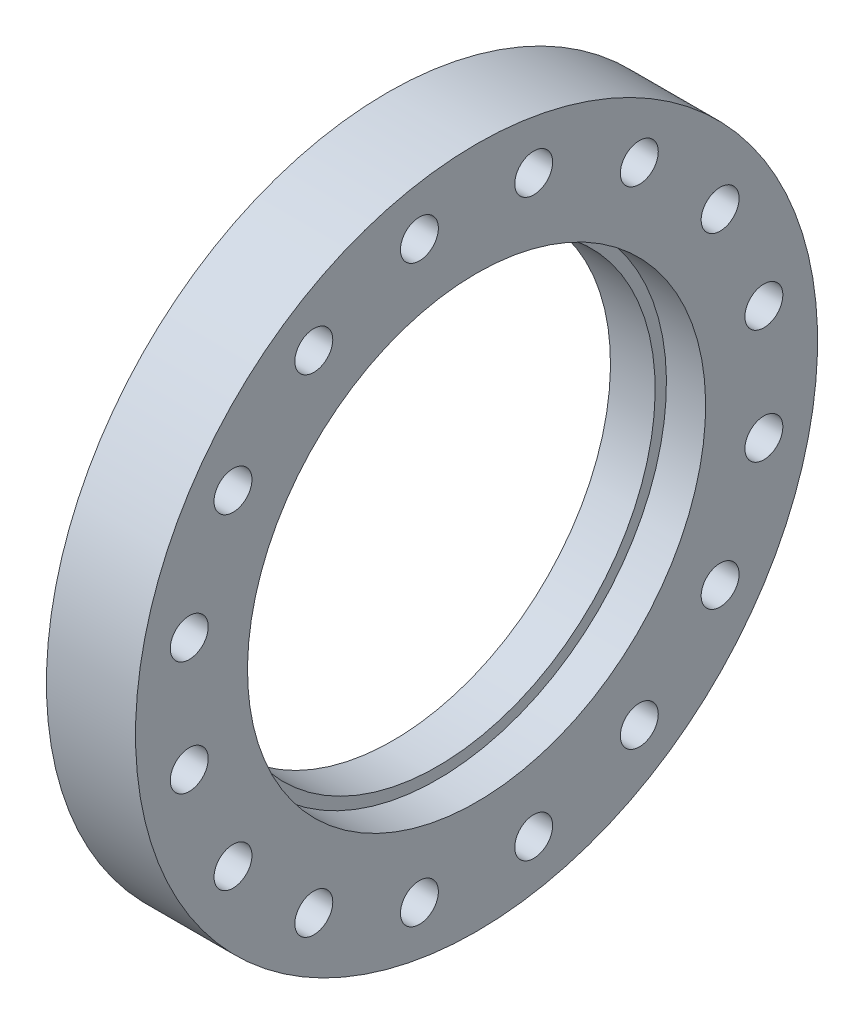
ISO-10303-21;
HEADER;
FILE_DESCRIPTION(('STEP AP214'),'2;1');
FILE_NAME('part.step','',(''),(''),'','','');
FILE_SCHEMA(('AUTOMOTIVE_DESIGN { 1 0 10303 214 1 1 1 1 }'));
ENDSEC;
DATA;
#1=APPLICATION_CONTEXT('core data for automotive mechanical design processes');
#2=APPLICATION_PROTOCOL_DEFINITION('international standard','automotive_design',2000,#1);
#3=PRODUCT_CONTEXT('',#1,'mechanical');
#4=PRODUCT('Part','Part','',(#3));
#5=PRODUCT_RELATED_PRODUCT_CATEGORY('part','',(#4));
#6=PRODUCT_DEFINITION_FORMATION('','',#4);
#7=PRODUCT_DEFINITION_CONTEXT('part definition',#1,'design');
#8=PRODUCT_DEFINITION('design','',#6,#7);
#9=PRODUCT_DEFINITION_SHAPE('','',#8);
#10=(LENGTH_UNIT() NAMED_UNIT(*) SI_UNIT(.MILLI.,.METRE.));
#11=(NAMED_UNIT(*) PLANE_ANGLE_UNIT() SI_UNIT($,.RADIAN.));
#12=(NAMED_UNIT(*) SI_UNIT($,.STERADIAN.) SOLID_ANGLE_UNIT());
#13=UNCERTAINTY_MEASURE_WITH_UNIT(LENGTH_MEASURE(1.E-05),#10,'distance_accuracy_value','');
#14=(GEOMETRIC_REPRESENTATION_CONTEXT(3) GLOBAL_UNCERTAINTY_ASSIGNED_CONTEXT((#13)) GLOBAL_UNIT_ASSIGNED_CONTEXT((#10,
#11,#12)) REPRESENTATION_CONTEXT('',''));
#15=CARTESIAN_POINT('',(0.,0.,0.));
#16=DIRECTION('',(0.,0.,1.));
#17=DIRECTION('',(1.,0.,0.));
#18=AXIS2_PLACEMENT_3D('',#15,#16,#17);
#19=CARTESIAN_POINT('',(1.17000000000035,53.038375,0.));
#20=DIRECTION('',(-1.,0.,0.));
#21=DIRECTION('',(0.,0.,1.));
#22=AXIS2_PLACEMENT_3D('',#19,#20,#21);
#23=PLANE('',#22);
#24=CARTESIAN_POINT('',(1.17000000000036,0.,0.));
#25=DIRECTION('',(1.,0.,0.));
#26=DIRECTION('',(0.,1.,0.));
#27=AXIS2_PLACEMENT_3D('',#24,#25,#26);
#28=CIRCLE('',#27,48.41875);
#29=CARTESIAN_POINT('',(1.17000000000035,48.41875,0.));
#30=VERTEX_POINT('',#29);
#31=EDGE_CURVE('E19',#30,#30,#28,.T.);
#32=ORIENTED_EDGE('',*,*,#31,.T.);
#33=EDGE_LOOP('',(#32));
#34=FACE_BOUND('',#33,.T.);
#35=CARTESIAN_POINT('',(1.17000000000036,0.,0.));
#36=DIRECTION('',(1.,0.,0.));
#37=DIRECTION('',(0.,1.,0.));
#38=AXIS2_PLACEMENT_3D('',#35,#36,#37);
#39=CIRCLE('',#38,57.658);
#40=CARTESIAN_POINT('',(1.17000000000035,57.658,0.));
#41=VERTEX_POINT('',#40);
#42=EDGE_CURVE('E142',#41,#41,#39,.F.);
#43=ORIENTED_EDGE('',*,*,#42,.T.);
#44=EDGE_LOOP('',(#43));
#45=FACE_BOUND('',#44,.T.);
#46=ADVANCED_FACE('F15',(#34,#45),#23,.T.);
#47=CARTESIAN_POINT('',(6.1349000000002,0.,0.));
#48=DIRECTION('',(1.,0.,0.));
#49=DIRECTION('',(0.,1.,0.));
#50=AXIS2_PLACEMENT_3D('',#47,#48,#49);
#51=CYLINDRICAL_SURFACE('',#50,48.41875);
#52=CARTESIAN_POINT('',(11.0998,0.,0.));
#53=DIRECTION('',(1.,0.,0.));
#54=DIRECTION('',(0.,1.,0.));
#55=AXIS2_PLACEMENT_3D('',#52,#53,#54);
#56=CIRCLE('',#55,48.41875);
#57=CARTESIAN_POINT('',(11.0998,48.41875,0.));
#58=VERTEX_POINT('',#57);
#59=EDGE_CURVE('E140',#58,#58,#56,.F.);
#60=ORIENTED_EDGE('',*,*,#59,.F.);
#61=EDGE_LOOP('',(#60));
#62=FACE_BOUND('',#61,.T.);
#63=ORIENTED_EDGE('',*,*,#31,.F.);
#64=EDGE_LOOP('',(#63));
#65=FACE_BOUND('',#64,.T.);
#66=ADVANCED_FACE('F150',(#62,#65),#51,.F.);
#67=CARTESIAN_POINT('',(0.915000000000277,0.,0.));
#68=DIRECTION('',(1.,0.,0.));
#69=DIRECTION('',(0.,1.,0.));
#70=AXIS2_PLACEMENT_3D('',#67,#68,#69);
#71=CYLINDRICAL_SURFACE('',#70,57.658);
#72=ORIENTED_EDGE('',*,*,#42,.F.);
#73=EDGE_LOOP('',(#72));
#74=FACE_BOUND('',#73,.T.);
#75=CARTESIAN_POINT('',(0.659999998138597,0.,0.));
#76=DIRECTION('',(1.,0.,0.));
#77=DIRECTION('',(0.,1.,0.));
#78=AXIS2_PLACEMENT_3D('',#75,#76,#77);
#79=CIRCLE('',#78,57.6580000006776);
#80=CARTESIAN_POINT('',(0.659999998138589,57.6580000006776,0.));
#81=VERTEX_POINT('',#80);
#82=EDGE_CURVE('E139',#81,#81,#79,.T.);
#83=ORIENTED_EDGE('',*,*,#82,.F.);
#84=EDGE_LOOP('',(#83));
#85=FACE_BOUND('',#84,.T.);
#86=ADVANCED_FACE('F152',(#74,#85),#71,.F.);
#87=CARTESIAN_POINT('',(11.0998,49.672875,0.));
#88=DIRECTION('',(1.,0.,0.));
#89=DIRECTION('',(0.,0.,-1.));
#90=AXIS2_PLACEMENT_3D('',#87,#88,#89);
#91=PLANE('',#90);
#92=ORIENTED_EDGE('',*,*,#59,.T.);
#93=EDGE_LOOP('',(#92));
#94=FACE_BOUND('',#93,.T.);
#95=CARTESIAN_POINT('',(11.0998,0.,0.));
#96=DIRECTION('',(1.,0.,0.));
#97=DIRECTION('',(0.,1.,0.));
#98=AXIS2_PLACEMENT_3D('',#95,#96,#97);
#99=CIRCLE('',#98,50.927);
#100=CARTESIAN_POINT('',(11.0998,50.927,0.));
#101=VERTEX_POINT('',#100);
#102=EDGE_CURVE('E136',#101,#101,#99,.T.);
#103=ORIENTED_EDGE('',*,*,#102,.T.);
#104=EDGE_LOOP('',(#103));
#105=FACE_BOUND('',#104,.T.);
#106=ADVANCED_FACE('F160',(#94,#105),#91,.T.);
#107=CARTESIAN_POINT('',(1.63070861664959,0.,0.));
#108=DIRECTION('',(1.,0.,0.));
#109=DIRECTION('',(0.,1.,0.));
#110=AXIS2_PLACEMENT_3D('',#107,#108,#109);
#111=CONICAL_SURFACE('',#110,60.3249999993224,1.22173047500006);
#112=ORIENTED_EDGE('',*,*,#82,.T.);
#113=EDGE_LOOP('',(#112));
#114=FACE_BOUND('',#113,.T.);
#115=CARTESIAN_POINT('',(1.63070861478799,0.,0.));
#116=DIRECTION('',(1.,0.,0.));
#117=DIRECTION('',(0.,1.,0.));
#118=AXIS2_PLACEMENT_3D('',#115,#116,#117);
#119=CIRCLE('',#118,60.3249999999999);
#120=CARTESIAN_POINT('',(1.63070861478798,60.3249999999999,0.));
#121=VERTEX_POINT('',#120);
#122=EDGE_CURVE('E135',#121,#121,#119,.F.);
#123=ORIENTED_EDGE('',*,*,#122,.T.);
#124=EDGE_LOOP('',(#123));
#125=FACE_BOUND('',#124,.T.);
#126=ADVANCED_FACE('F188',(#114,#125),#111,.T.);
#127=CARTESIAN_POINT('',(15.4558999999997,0.,0.));
#128=DIRECTION('',(1.,0.,0.));
#129=DIRECTION('',(0.,1.,0.));
#130=AXIS2_PLACEMENT_3D('',#127,#128,#129);
#131=CYLINDRICAL_SURFACE('',#130,50.927);
#132=CARTESIAN_POINT('',(19.8119999999994,0.,0.));
#133=DIRECTION('',(1.,0.,0.));
#134=DIRECTION('',(0.,1.,0.));
#135=AXIS2_PLACEMENT_3D('',#132,#133,#134);
#136=CIRCLE('',#135,50.927);
#137=CARTESIAN_POINT('',(19.8119999999994,50.927,0.));
#138=VERTEX_POINT('',#137);
#139=EDGE_CURVE('E84',#138,#138,#136,.F.);
#140=ORIENTED_EDGE('',*,*,#139,.F.);
#141=EDGE_LOOP('',(#140));
#142=FACE_BOUND('',#141,.T.);
#143=ORIENTED_EDGE('',*,*,#102,.F.);
#144=EDGE_LOOP('',(#143));
#145=FACE_BOUND('',#144,.T.);
#146=ADVANCED_FACE('F184',(#142,#145),#131,.F.);
#147=CARTESIAN_POINT('',(0.,54.1499573829707,36.1818447675414));
#148=DIRECTION('',(1.,0.,0.));
#149=DIRECTION('',(0.,1.,0.));
#150=AXIS2_PLACEMENT_3D('',#147,#148,#149);
#151=CYLINDRICAL_SURFACE('',#150,4.2164);
#152=CARTESIAN_POINT('',(0.,54.1499573829707,36.1818447675414));
#153=DIRECTION('',(1.,0.,0.));
#154=DIRECTION('',(0.,1.,0.));
#155=AXIS2_PLACEMENT_3D('',#152,#153,#154);
#156=CIRCLE('',#155,4.2164);
#157=CARTESIAN_POINT('',(0.,58.3663573829707,36.1818447675414));
#158=VERTEX_POINT('',#157);
#159=EDGE_CURVE('E81',#158,#158,#156,.T.);
#160=ORIENTED_EDGE('',*,*,#159,.F.);
#161=EDGE_LOOP('',(#160));
#162=FACE_BOUND('',#161,.T.);
#163=CARTESIAN_POINT('',(19.8119999999994,54.1499573829707,36.1818447675414));
#164=DIRECTION('',(1.,0.,0.));
#165=DIRECTION('',(0.,1.,0.));
#166=AXIS2_PLACEMENT_3D('',#163,#164,#165);
#167=CIRCLE('',#166,4.2164);
#168=CARTESIAN_POINT('',(19.8119999999994,58.3663573829707,36.1818447675414));
#169=VERTEX_POINT('',#168);
#170=EDGE_CURVE('E132',#169,#169,#167,.F.);
#171=ORIENTED_EDGE('',*,*,#170,.F.);
#172=EDGE_LOOP('',(#171));
#173=FACE_BOUND('',#172,.T.);
#174=ADVANCED_FACE('F187',(#162,#173),#151,.F.);
#175=CARTESIAN_POINT('',(0.,63.8742298574287,12.7053742754935));
#176=DIRECTION('',(1.,0.,0.));
#177=DIRECTION('',(0.,0.,-1.));
#178=AXIS2_PLACEMENT_3D('',#175,#176,#177);
#179=CYLINDRICAL_SURFACE('',#178,4.21640000000001);
#180=CARTESIAN_POINT('',(0.,63.8742298574287,12.7053742754935));
#181=DIRECTION('',(1.,0.,0.));
#182=DIRECTION('',(0.,0.,-1.));
#183=AXIS2_PLACEMENT_3D('',#180,#181,#182);
#184=CIRCLE('',#183,4.21640000000001);
#185=CARTESIAN_POINT('',(0.,63.8742298574287,8.4889742754935));
#186=VERTEX_POINT('',#185);
#187=EDGE_CURVE('E78',#186,#186,#184,.T.);
#188=ORIENTED_EDGE('',*,*,#187,.F.);
#189=EDGE_LOOP('',(#188));
#190=FACE_BOUND('',#189,.T.);
#191=CARTESIAN_POINT('',(19.8119999999994,63.8742298574287,12.7053742754935));
#192=DIRECTION('',(1.,0.,0.));
#193=DIRECTION('',(0.,0.,-1.));
#194=AXIS2_PLACEMENT_3D('',#191,#192,#193);
#195=CIRCLE('',#194,4.21640000000001);
#196=CARTESIAN_POINT('',(19.8119999999994,63.8742298574287,8.4889742754935));
#197=VERTEX_POINT('',#196);
#198=EDGE_CURVE('E129',#197,#197,#195,.F.);
#199=ORIENTED_EDGE('',*,*,#198,.F.);
#200=EDGE_LOOP('',(#199));
#201=FACE_BOUND('',#200,.T.);
#202=ADVANCED_FACE('F218',(#190,#201),#179,.F.);
#203=CARTESIAN_POINT('',(0.,63.8742298574286,-12.7053742754936));
#204=DIRECTION('',(1.,0.,0.));
#205=DIRECTION('',(0.,0.,-1.));
#206=AXIS2_PLACEMENT_3D('',#203,#204,#205);
#207=CYLINDRICAL_SURFACE('',#206,4.21639999999999);
#208=CARTESIAN_POINT('',(0.,63.8742298574286,-12.7053742754936));
#209=DIRECTION('',(1.,0.,0.));
#210=DIRECTION('',(0.,0.,-1.));
#211=AXIS2_PLACEMENT_3D('',#208,#209,#210);
#212=CIRCLE('',#211,4.21639999999999);
#213=CARTESIAN_POINT('',(0.,63.8742298574286,-16.9217742754936));
#214=VERTEX_POINT('',#213);
#215=EDGE_CURVE('E75',#214,#214,#212,.T.);
#216=ORIENTED_EDGE('',*,*,#215,.F.);
#217=EDGE_LOOP('',(#216));
#218=FACE_BOUND('',#217,.T.);
#219=CARTESIAN_POINT('',(19.8119999999994,63.8742298574286,-12.7053742754936));
#220=DIRECTION('',(1.,0.,0.));
#221=DIRECTION('',(0.,0.,-1.));
#222=AXIS2_PLACEMENT_3D('',#219,#220,#221);
#223=CIRCLE('',#222,4.21639999999999);
#224=CARTESIAN_POINT('',(19.8119999999994,63.8742298574286,-16.9217742754936));
#225=VERTEX_POINT('',#224);
#226=EDGE_CURVE('E126',#225,#225,#223,.F.);
#227=ORIENTED_EDGE('',*,*,#226,.F.);
#228=EDGE_LOOP('',(#227));
#229=FACE_BOUND('',#228,.T.);
#230=ADVANCED_FACE('F226',(#218,#229),#207,.F.);
#231=CARTESIAN_POINT('',(0.,54.1499573829706,-36.1818447675415));
#232=DIRECTION('',(1.,0.,0.));
#233=DIRECTION('',(0.,0.,-1.));
#234=AXIS2_PLACEMENT_3D('',#231,#232,#233);
#235=CYLINDRICAL_SURFACE('',#234,4.21639999999998);
#236=CARTESIAN_POINT('',(0.,54.1499573829706,-36.1818447675415));
#237=DIRECTION('',(1.,0.,0.));
#238=DIRECTION('',(0.,0.,-1.));
#239=AXIS2_PLACEMENT_3D('',#236,#237,#238);
#240=CIRCLE('',#239,4.21639999999998);
#241=CARTESIAN_POINT('',(0.,54.1499573829706,-40.3982447675415));
#242=VERTEX_POINT('',#241);
#243=EDGE_CURVE('E72',#242,#242,#240,.T.);
#244=ORIENTED_EDGE('',*,*,#243,.F.);
#245=EDGE_LOOP('',(#244));
#246=FACE_BOUND('',#245,.T.);
#247=CARTESIAN_POINT('',(19.8119999999994,54.1499573829706,-36.1818447675415));
#248=DIRECTION('',(1.,0.,0.));
#249=DIRECTION('',(0.,0.,-1.));
#250=AXIS2_PLACEMENT_3D('',#247,#248,#249);
#251=CIRCLE('',#250,4.21639999999998);
#252=CARTESIAN_POINT('',(19.8119999999994,54.1499573829706,-40.3982447675415));
#253=VERTEX_POINT('',#252);
#254=EDGE_CURVE('E123',#253,#253,#251,.F.);
#255=ORIENTED_EDGE('',*,*,#254,.F.);
#256=EDGE_LOOP('',(#255));
#257=FACE_BOUND('',#256,.T.);
#258=ADVANCED_FACE('F234',(#246,#257),#235,.F.);
#259=CARTESIAN_POINT('',(0.,36.1818447675414,-54.1499573829707));
#260=DIRECTION('',(1.,0.,0.));
#261=DIRECTION('',(0.,1.,0.));
#262=AXIS2_PLACEMENT_3D('',#259,#260,#261);
#263=CYLINDRICAL_SURFACE('',#262,4.2164);
#264=CARTESIAN_POINT('',(0.,36.1818447675414,-54.1499573829707));
#265=DIRECTION('',(1.,0.,0.));
#266=DIRECTION('',(0.,1.,0.));
#267=AXIS2_PLACEMENT_3D('',#264,#265,#266);
#268=CIRCLE('',#267,4.2164);
#269=CARTESIAN_POINT('',(0.,40.3982447675414,-54.1499573829707));
#270=VERTEX_POINT('',#269);
#271=EDGE_CURVE('E69',#270,#270,#268,.T.);
#272=ORIENTED_EDGE('',*,*,#271,.F.);
#273=EDGE_LOOP('',(#272));
#274=FACE_BOUND('',#273,.T.);
#275=CARTESIAN_POINT('',(19.8119999999994,36.1818447675414,-54.1499573829707));
#276=DIRECTION('',(1.,0.,0.));
#277=DIRECTION('',(0.,1.,0.));
#278=AXIS2_PLACEMENT_3D('',#275,#276,#277);
#279=CIRCLE('',#278,4.2164);
#280=CARTESIAN_POINT('',(19.8119999999994,40.3982447675414,-54.1499573829707));
#281=VERTEX_POINT('',#280);
#282=EDGE_CURVE('E120',#281,#281,#279,.F.);
#283=ORIENTED_EDGE('',*,*,#282,.F.);
#284=EDGE_LOOP('',(#283));
#285=FACE_BOUND('',#284,.T.);
#286=ADVANCED_FACE('F242',(#274,#285),#263,.F.);
#287=CARTESIAN_POINT('',(0.,12.7053742754936,-63.8742298574286));
#288=DIRECTION('',(1.,0.,0.));
#289=DIRECTION('',(0.,1.,0.));
#290=AXIS2_PLACEMENT_3D('',#287,#288,#289);
#291=CYLINDRICAL_SURFACE('',#290,4.21639999999999);
#292=CARTESIAN_POINT('',(0.,12.7053742754936,-63.8742298574286));
#293=DIRECTION('',(1.,0.,0.));
#294=DIRECTION('',(0.,1.,0.));
#295=AXIS2_PLACEMENT_3D('',#292,#293,#294);
#296=CIRCLE('',#295,4.21639999999999);
#297=CARTESIAN_POINT('',(0.,16.9217742754935,-63.8742298574286));
#298=VERTEX_POINT('',#297);
#299=EDGE_CURVE('E66',#298,#298,#296,.T.);
#300=ORIENTED_EDGE('',*,*,#299,.F.);
#301=EDGE_LOOP('',(#300));
#302=FACE_BOUND('',#301,.T.);
#303=CARTESIAN_POINT('',(19.8119999999994,12.7053742754936,-63.8742298574286));
#304=DIRECTION('',(1.,0.,0.));
#305=DIRECTION('',(0.,1.,0.));
#306=AXIS2_PLACEMENT_3D('',#303,#304,#305);
#307=CIRCLE('',#306,4.21639999999999);
#308=CARTESIAN_POINT('',(19.8119999999994,16.9217742754935,-63.8742298574286));
#309=VERTEX_POINT('',#308);
#310=EDGE_CURVE('E117',#309,#309,#307,.F.);
#311=ORIENTED_EDGE('',*,*,#310,.F.);
#312=EDGE_LOOP('',(#311));
#313=FACE_BOUND('',#312,.T.);
#314=ADVANCED_FACE('F250',(#302,#313),#291,.F.);
#315=CARTESIAN_POINT('',(0.,-12.7053742754936,-63.8742298574286));
#316=DIRECTION('',(1.,0.,0.));
#317=DIRECTION('',(0.,1.,0.));
#318=AXIS2_PLACEMENT_3D('',#315,#316,#317);
#319=CYLINDRICAL_SURFACE('',#318,4.21639999999999);
#320=CARTESIAN_POINT('',(0.,-12.7053742754936,-63.8742298574286));
#321=DIRECTION('',(1.,0.,0.));
#322=DIRECTION('',(0.,1.,0.));
#323=AXIS2_PLACEMENT_3D('',#320,#321,#322);
#324=CIRCLE('',#323,4.21639999999999);
#325=CARTESIAN_POINT('',(0.,-8.48897427549359,-63.8742298574286));
#326=VERTEX_POINT('',#325);
#327=EDGE_CURVE('E63',#326,#326,#324,.T.);
#328=ORIENTED_EDGE('',*,*,#327,.F.);
#329=EDGE_LOOP('',(#328));
#330=FACE_BOUND('',#329,.T.);
#331=CARTESIAN_POINT('',(19.8119999999994,-12.7053742754936,-63.8742298574286));
#332=DIRECTION('',(1.,0.,0.));
#333=DIRECTION('',(0.,1.,0.));
#334=AXIS2_PLACEMENT_3D('',#331,#332,#333);
#335=CIRCLE('',#334,4.21639999999999);
#336=CARTESIAN_POINT('',(19.8119999999994,-8.48897427549359,-63.8742298574286));
#337=VERTEX_POINT('',#336);
#338=EDGE_CURVE('E114',#337,#337,#335,.F.);
#339=ORIENTED_EDGE('',*,*,#338,.F.);
#340=EDGE_LOOP('',(#339));
#341=FACE_BOUND('',#340,.T.);
#342=ADVANCED_FACE('F258',(#330,#341),#319,.F.);
#343=CARTESIAN_POINT('',(0.,-36.1818447675414,-54.1499573829706));
#344=DIRECTION('',(1.,0.,0.));
#345=DIRECTION('',(0.,1.,0.));
#346=AXIS2_PLACEMENT_3D('',#343,#344,#345);
#347=CYLINDRICAL_SURFACE('',#346,4.21639999999998);
#348=CARTESIAN_POINT('',(0.,-36.1818447675414,-54.1499573829706));
#349=DIRECTION('',(1.,0.,0.));
#350=DIRECTION('',(0.,1.,0.));
#351=AXIS2_PLACEMENT_3D('',#348,#349,#350);
#352=CIRCLE('',#351,4.21639999999998);
#353=CARTESIAN_POINT('',(0.,-31.9654447675415,-54.1499573829706));
#354=VERTEX_POINT('',#353);
#355=EDGE_CURVE('E60',#354,#354,#352,.T.);
#356=ORIENTED_EDGE('',*,*,#355,.F.);
#357=EDGE_LOOP('',(#356));
#358=FACE_BOUND('',#357,.T.);
#359=CARTESIAN_POINT('',(19.8119999999994,-36.1818447675414,-54.1499573829706));
#360=DIRECTION('',(1.,0.,0.));
#361=DIRECTION('',(0.,1.,0.));
#362=AXIS2_PLACEMENT_3D('',#359,#360,#361);
#363=CIRCLE('',#362,4.21639999999998);
#364=CARTESIAN_POINT('',(19.8119999999994,-31.9654447675415,-54.1499573829706));
#365=VERTEX_POINT('',#364);
#366=EDGE_CURVE('E111',#365,#365,#363,.F.);
#367=ORIENTED_EDGE('',*,*,#366,.F.);
#368=EDGE_LOOP('',(#367));
#369=FACE_BOUND('',#368,.T.);
#370=ADVANCED_FACE('F266',(#358,#369),#347,.F.);
#371=CARTESIAN_POINT('',(0.,-54.1499573829707,-36.1818447675414));
#372=DIRECTION('',(1.,0.,0.));
#373=DIRECTION('',(0.,0.,-1.));
#374=AXIS2_PLACEMENT_3D('',#371,#372,#373);
#375=CYLINDRICAL_SURFACE('',#374,4.2164);
#376=CARTESIAN_POINT('',(0.,-54.1499573829707,-36.1818447675414));
#377=DIRECTION('',(1.,0.,0.));
#378=DIRECTION('',(0.,0.,-1.));
#379=AXIS2_PLACEMENT_3D('',#376,#377,#378);
#380=CIRCLE('',#379,4.2164);
#381=CARTESIAN_POINT('',(0.,-54.1499573829707,-40.3982447675414));
#382=VERTEX_POINT('',#381);
#383=EDGE_CURVE('E57',#382,#382,#380,.T.);
#384=ORIENTED_EDGE('',*,*,#383,.F.);
#385=EDGE_LOOP('',(#384));
#386=FACE_BOUND('',#385,.T.);
#387=CARTESIAN_POINT('',(19.8119999999994,-54.1499573829707,-36.1818447675414));
#388=DIRECTION('',(1.,0.,0.));
#389=DIRECTION('',(0.,0.,-1.));
#390=AXIS2_PLACEMENT_3D('',#387,#388,#389);
#391=CIRCLE('',#390,4.2164);
#392=CARTESIAN_POINT('',(19.8119999999994,-54.1499573829707,-40.3982447675414));
#393=VERTEX_POINT('',#392);
#394=EDGE_CURVE('E108',#393,#393,#391,.F.);
#395=ORIENTED_EDGE('',*,*,#394,.F.);
#396=EDGE_LOOP('',(#395));
#397=FACE_BOUND('',#396,.T.);
#398=ADVANCED_FACE('F274',(#386,#397),#375,.F.);
#399=CARTESIAN_POINT('',(0.,-63.8742298574287,-12.7053742754935));
#400=DIRECTION('',(1.,0.,0.));
#401=DIRECTION('',(0.,0.,-1.));
#402=AXIS2_PLACEMENT_3D('',#399,#400,#401);
#403=CYLINDRICAL_SURFACE('',#402,4.21640000000001);
#404=CARTESIAN_POINT('',(0.,-63.8742298574287,-12.7053742754935));
#405=DIRECTION('',(1.,0.,0.));
#406=DIRECTION('',(0.,0.,-1.));
#407=AXIS2_PLACEMENT_3D('',#404,#405,#406);
#408=CIRCLE('',#407,4.21640000000001);
#409=CARTESIAN_POINT('',(0.,-63.8742298574287,-16.9217742754935));
#410=VERTEX_POINT('',#409);
#411=EDGE_CURVE('E54',#410,#410,#408,.T.);
#412=ORIENTED_EDGE('',*,*,#411,.F.);
#413=EDGE_LOOP('',(#412));
#414=FACE_BOUND('',#413,.T.);
#415=CARTESIAN_POINT('',(19.8119999999994,-63.8742298574287,-12.7053742754935));
#416=DIRECTION('',(1.,0.,0.));
#417=DIRECTION('',(0.,0.,-1.));
#418=AXIS2_PLACEMENT_3D('',#415,#416,#417);
#419=CIRCLE('',#418,4.21640000000001);
#420=CARTESIAN_POINT('',(19.8119999999994,-63.8742298574287,-16.9217742754935));
#421=VERTEX_POINT('',#420);
#422=EDGE_CURVE('E105',#421,#421,#419,.F.);
#423=ORIENTED_EDGE('',*,*,#422,.F.);
#424=EDGE_LOOP('',(#423));
#425=FACE_BOUND('',#424,.T.);
#426=ADVANCED_FACE('F282',(#414,#425),#403,.F.);
#427=CARTESIAN_POINT('',(0.,-63.8742298574286,12.7053742754936));
#428=DIRECTION('',(1.,0.,0.));
#429=DIRECTION('',(0.,0.,-1.));
#430=AXIS2_PLACEMENT_3D('',#427,#428,#429);
#431=CYLINDRICAL_SURFACE('',#430,4.21639999999999);
#432=CARTESIAN_POINT('',(0.,-63.8742298574286,12.7053742754936));
#433=DIRECTION('',(1.,0.,0.));
#434=DIRECTION('',(0.,0.,-1.));
#435=AXIS2_PLACEMENT_3D('',#432,#433,#434);
#436=CIRCLE('',#435,4.21639999999999);
#437=CARTESIAN_POINT('',(0.,-63.8742298574286,8.48897427549362));
#438=VERTEX_POINT('',#437);
#439=EDGE_CURVE('E51',#438,#438,#436,.T.);
#440=ORIENTED_EDGE('',*,*,#439,.F.);
#441=EDGE_LOOP('',(#440));
#442=FACE_BOUND('',#441,.T.);
#443=CARTESIAN_POINT('',(19.8119999999994,-63.8742298574286,12.7053742754936));
#444=DIRECTION('',(1.,0.,0.));
#445=DIRECTION('',(0.,0.,-1.));
#446=AXIS2_PLACEMENT_3D('',#443,#444,#445);
#447=CIRCLE('',#446,4.21639999999999);
#448=CARTESIAN_POINT('',(19.8119999999994,-63.8742298574286,8.48897427549362));
#449=VERTEX_POINT('',#448);
#450=EDGE_CURVE('E102',#449,#449,#447,.F.);
#451=ORIENTED_EDGE('',*,*,#450,.F.);
#452=EDGE_LOOP('',(#451));
#453=FACE_BOUND('',#452,.T.);
#454=ADVANCED_FACE('F290',(#442,#453),#431,.F.);
#455=CARTESIAN_POINT('',(0.,-54.1499573829706,36.1818447675414));
#456=DIRECTION('',(1.,0.,0.));
#457=DIRECTION('',(0.,0.,-1.));
#458=AXIS2_PLACEMENT_3D('',#455,#456,#457);
#459=CYLINDRICAL_SURFACE('',#458,4.21639999999998);
#460=CARTESIAN_POINT('',(0.,-54.1499573829706,36.1818447675414));
#461=DIRECTION('',(1.,0.,0.));
#462=DIRECTION('',(0.,0.,-1.));
#463=AXIS2_PLACEMENT_3D('',#460,#461,#462);
#464=CIRCLE('',#463,4.21639999999998);
#465=CARTESIAN_POINT('',(0.,-54.1499573829706,31.9654447675415));
#466=VERTEX_POINT('',#465);
#467=EDGE_CURVE('E48',#466,#466,#464,.T.);
#468=ORIENTED_EDGE('',*,*,#467,.F.);
#469=EDGE_LOOP('',(#468));
#470=FACE_BOUND('',#469,.T.);
#471=CARTESIAN_POINT('',(19.8119999999994,-54.1499573829706,36.1818447675414));
#472=DIRECTION('',(1.,0.,0.));
#473=DIRECTION('',(0.,0.,-1.));
#474=AXIS2_PLACEMENT_3D('',#471,#472,#473);
#475=CIRCLE('',#474,4.21639999999998);
#476=CARTESIAN_POINT('',(19.8119999999994,-54.1499573829706,31.9654447675415));
#477=VERTEX_POINT('',#476);
#478=EDGE_CURVE('E99',#477,#477,#475,.F.);
#479=ORIENTED_EDGE('',*,*,#478,.F.);
#480=EDGE_LOOP('',(#479));
#481=FACE_BOUND('',#480,.T.);
#482=ADVANCED_FACE('F298',(#470,#481),#459,.F.);
#483=CARTESIAN_POINT('',(0.,-36.1818447675414,54.1499573829707));
#484=DIRECTION('',(1.,0.,0.));
#485=DIRECTION('',(0.,0.,-1.));
#486=AXIS2_PLACEMENT_3D('',#483,#484,#485);
#487=CYLINDRICAL_SURFACE('',#486,4.2164);
#488=CARTESIAN_POINT('',(0.,-36.1818447675414,54.1499573829707));
#489=DIRECTION('',(1.,0.,0.));
#490=DIRECTION('',(0.,0.,-1.));
#491=AXIS2_PLACEMENT_3D('',#488,#489,#490);
#492=CIRCLE('',#491,4.2164);
#493=CARTESIAN_POINT('',(0.,-36.1818447675414,49.9335573829707));
#494=VERTEX_POINT('',#493);
#495=EDGE_CURVE('E45',#494,#494,#492,.T.);
#496=ORIENTED_EDGE('',*,*,#495,.F.);
#497=EDGE_LOOP('',(#496));
#498=FACE_BOUND('',#497,.T.);
#499=CARTESIAN_POINT('',(19.8119999999994,-36.1818447675414,54.1499573829707));
#500=DIRECTION('',(1.,0.,0.));
#501=DIRECTION('',(0.,0.,-1.));
#502=AXIS2_PLACEMENT_3D('',#499,#500,#501);
#503=CIRCLE('',#502,4.2164);
#504=CARTESIAN_POINT('',(19.8119999999994,-36.1818447675414,49.9335573829707));
#505=VERTEX_POINT('',#504);
#506=EDGE_CURVE('E96',#505,#505,#503,.F.);
#507=ORIENTED_EDGE('',*,*,#506,.F.);
#508=EDGE_LOOP('',(#507));
#509=FACE_BOUND('',#508,.T.);
#510=ADVANCED_FACE('F306',(#498,#509),#487,.F.);
#511=CARTESIAN_POINT('',(0.,-12.7053742754935,63.8742298574286));
#512=DIRECTION('',(1.,0.,0.));
#513=DIRECTION('',(0.,1.,0.));
#514=AXIS2_PLACEMENT_3D('',#511,#512,#513);
#515=CYLINDRICAL_SURFACE('',#514,4.21639999999999);
#516=CARTESIAN_POINT('',(0.,-12.7053742754935,63.8742298574286));
#517=DIRECTION('',(1.,0.,0.));
#518=DIRECTION('',(0.,1.,0.));
#519=AXIS2_PLACEMENT_3D('',#516,#517,#518);
#520=CIRCLE('',#519,4.21639999999999);
#521=CARTESIAN_POINT('',(0.,-8.48897427549355,63.8742298574286));
#522=VERTEX_POINT('',#521);
#523=EDGE_CURVE('E42',#522,#522,#520,.T.);
#524=ORIENTED_EDGE('',*,*,#523,.F.);
#525=EDGE_LOOP('',(#524));
#526=FACE_BOUND('',#525,.T.);
#527=CARTESIAN_POINT('',(19.8119999999994,-12.7053742754935,63.8742298574286));
#528=DIRECTION('',(1.,0.,0.));
#529=DIRECTION('',(0.,1.,0.));
#530=AXIS2_PLACEMENT_3D('',#527,#528,#529);
#531=CIRCLE('',#530,4.21639999999999);
#532=CARTESIAN_POINT('',(19.8119999999994,-8.48897427549355,63.8742298574286));
#533=VERTEX_POINT('',#532);
#534=EDGE_CURVE('E93',#533,#533,#531,.F.);
#535=ORIENTED_EDGE('',*,*,#534,.F.);
#536=EDGE_LOOP('',(#535));
#537=FACE_BOUND('',#536,.T.);
#538=ADVANCED_FACE('F314',(#526,#537),#515,.F.);
#539=CARTESIAN_POINT('',(0.,36.1818447675415,54.1499573829706));
#540=DIRECTION('',(1.,0.,0.));
#541=DIRECTION('',(0.,1.,0.));
#542=AXIS2_PLACEMENT_3D('',#539,#540,#541);
#543=CYLINDRICAL_SURFACE('',#542,4.21639999999999);
#544=CARTESIAN_POINT('',(0.,36.1818447675415,54.1499573829706));
#545=DIRECTION('',(1.,0.,0.));
#546=DIRECTION('',(0.,1.,0.));
#547=AXIS2_PLACEMENT_3D('',#544,#545,#546);
#548=CIRCLE('',#547,4.21639999999999);
#549=CARTESIAN_POINT('',(0.,40.3982447675415,54.1499573829706));
#550=VERTEX_POINT('',#549);
#551=EDGE_CURVE('E39',#550,#550,#548,.T.);
#552=ORIENTED_EDGE('',*,*,#551,.F.);
#553=EDGE_LOOP('',(#552));
#554=FACE_BOUND('',#553,.T.);
#555=CARTESIAN_POINT('',(19.8119999999994,36.1818447675415,54.1499573829706));
#556=DIRECTION('',(1.,0.,0.));
#557=DIRECTION('',(0.,1.,0.));
#558=AXIS2_PLACEMENT_3D('',#555,#556,#557);
#559=CIRCLE('',#558,4.21639999999999);
#560=CARTESIAN_POINT('',(19.8119999999994,40.3982447675415,54.1499573829706));
#561=VERTEX_POINT('',#560);
#562=EDGE_CURVE('E90',#561,#561,#559,.F.);
#563=ORIENTED_EDGE('',*,*,#562,.F.);
#564=EDGE_LOOP('',(#563));
#565=FACE_BOUND('',#564,.T.);
#566=ADVANCED_FACE('F322',(#554,#565),#543,.F.);
#567=CARTESIAN_POINT('',(0.,12.7053742754936,63.8742298574286));
#568=DIRECTION('',(1.,0.,0.));
#569=DIRECTION('',(0.,1.,0.));
#570=AXIS2_PLACEMENT_3D('',#567,#568,#569);
#571=CYLINDRICAL_SURFACE('',#570,4.21639999999999);
#572=CARTESIAN_POINT('',(0.,12.7053742754936,63.8742298574286));
#573=DIRECTION('',(1.,0.,0.));
#574=DIRECTION('',(0.,1.,0.));
#575=AXIS2_PLACEMENT_3D('',#572,#573,#574);
#576=CIRCLE('',#575,4.21639999999999);
#577=CARTESIAN_POINT('',(0.,16.9217742754936,63.8742298574286));
#578=VERTEX_POINT('',#577);
#579=EDGE_CURVE('E36',#578,#578,#576,.T.);
#580=ORIENTED_EDGE('',*,*,#579,.F.);
#581=EDGE_LOOP('',(#580));
#582=FACE_BOUND('',#581,.T.);
#583=CARTESIAN_POINT('',(19.8119999999994,12.7053742754936,63.8742298574286));
#584=DIRECTION('',(1.,0.,0.));
#585=DIRECTION('',(0.,1.,0.));
#586=AXIS2_PLACEMENT_3D('',#583,#584,#585);
#587=CIRCLE('',#586,4.21639999999999);
#588=CARTESIAN_POINT('',(19.8119999999994,16.9217742754936,63.8742298574286));
#589=VERTEX_POINT('',#588);
#590=EDGE_CURVE('E87',#589,#589,#587,.F.);
#591=ORIENTED_EDGE('',*,*,#590,.F.);
#592=EDGE_LOOP('',(#591));
#593=FACE_BOUND('',#592,.T.);
#594=ADVANCED_FACE('F17',(#582,#593),#571,.F.);
#595=CARTESIAN_POINT('',(0.815354307394017,0.,0.));
#596=DIRECTION('',(1.,0.,0.));
#597=DIRECTION('',(0.,1.,0.));
#598=AXIS2_PLACEMENT_3D('',#595,#596,#597);
#599=CYLINDRICAL_SURFACE('',#598,60.3249999999999);
#600=ORIENTED_EDGE('',*,*,#122,.F.);
#601=EDGE_LOOP('',(#600));
#602=FACE_BOUND('',#601,.T.);
#603=CARTESIAN_POINT('',(0.,0.,0.));
#604=DIRECTION('',(1.,0.,0.));
#605=DIRECTION('',(0.,1.,0.));
#606=AXIS2_PLACEMENT_3D('',#603,#604,#605);
#607=CIRCLE('',#606,60.3249999999999);
#608=CARTESIAN_POINT('',(0.,60.3249999999999,0.));
#609=VERTEX_POINT('',#608);
#610=EDGE_CURVE('E28',#609,#609,#607,.T.);
#611=ORIENTED_EDGE('',*,*,#610,.F.);
#612=EDGE_LOOP('',(#611));
#613=FACE_BOUND('',#612,.T.);
#614=ADVANCED_FACE('F179',(#602,#613),#599,.F.);
#615=CARTESIAN_POINT('',(19.8119999999994,63.3729999999994,0.));
#616=DIRECTION('',(1.,0.,0.));
#617=DIRECTION('',(0.,0.,-1.));
#618=AXIS2_PLACEMENT_3D('',#615,#616,#617);
#619=PLANE('',#618);
#620=ORIENTED_EDGE('',*,*,#139,.T.);
#621=EDGE_LOOP('',(#620));
#622=FACE_BOUND('',#621,.T.);
#623=ORIENTED_EDGE('',*,*,#590,.T.);
#624=EDGE_LOOP('',(#623));
#625=FACE_BOUND('',#624,.T.);
#626=ORIENTED_EDGE('',*,*,#562,.T.);
#627=EDGE_LOOP('',(#626));
#628=FACE_BOUND('',#627,.T.);
#629=ORIENTED_EDGE('',*,*,#534,.T.);
#630=EDGE_LOOP('',(#629));
#631=FACE_BOUND('',#630,.T.);
#632=ORIENTED_EDGE('',*,*,#506,.T.);
#633=EDGE_LOOP('',(#632));
#634=FACE_BOUND('',#633,.T.);
#635=ORIENTED_EDGE('',*,*,#478,.T.);
#636=EDGE_LOOP('',(#635));
#637=FACE_BOUND('',#636,.T.);
#638=ORIENTED_EDGE('',*,*,#450,.T.);
#639=EDGE_LOOP('',(#638));
#640=FACE_BOUND('',#639,.T.);
#641=ORIENTED_EDGE('',*,*,#422,.T.);
#642=EDGE_LOOP('',(#641));
#643=FACE_BOUND('',#642,.T.);
#644=ORIENTED_EDGE('',*,*,#394,.T.);
#645=EDGE_LOOP('',(#644));
#646=FACE_BOUND('',#645,.T.);
#647=ORIENTED_EDGE('',*,*,#366,.T.);
#648=EDGE_LOOP('',(#647));
#649=FACE_BOUND('',#648,.T.);
#650=ORIENTED_EDGE('',*,*,#338,.T.);
#651=EDGE_LOOP('',(#650));
#652=FACE_BOUND('',#651,.T.);
#653=ORIENTED_EDGE('',*,*,#310,.T.);
#654=EDGE_LOOP('',(#653));
#655=FACE_BOUND('',#654,.T.);
#656=ORIENTED_EDGE('',*,*,#282,.T.);
#657=EDGE_LOOP('',(#656));
#658=FACE_BOUND('',#657,.T.);
#659=ORIENTED_EDGE('',*,*,#254,.T.);
#660=EDGE_LOOP('',(#659));
#661=FACE_BOUND('',#660,.T.);
#662=ORIENTED_EDGE('',*,*,#226,.T.);
#663=EDGE_LOOP('',(#662));
#664=FACE_BOUND('',#663,.T.);
#665=ORIENTED_EDGE('',*,*,#198,.T.);
#666=EDGE_LOOP('',(#665));
#667=FACE_BOUND('',#666,.T.);
#668=ORIENTED_EDGE('',*,*,#170,.T.);
#669=EDGE_LOOP('',(#668));
#670=FACE_BOUND('',#669,.T.);
#671=CARTESIAN_POINT('',(19.8119999999994,0.,0.));
#672=DIRECTION('',(1.,0.,0.));
#673=DIRECTION('',(0.,1.,0.));
#674=AXIS2_PLACEMENT_3D('',#671,#672,#673);
#675=CIRCLE('',#674,75.8189999999988);
#676=CARTESIAN_POINT('',(19.8119999999994,75.8189999999988,0.));
#677=VERTEX_POINT('',#676);
#678=EDGE_CURVE('E23',#677,#677,#675,.F.);
#679=ORIENTED_EDGE('',*,*,#678,.F.);
#680=EDGE_LOOP('',(#679));
#681=FACE_BOUND('',#680,.T.);
#682=ADVANCED_FACE('F172',(#622,#625,#628,#631,#634,#637,#640,#643,#646,#649,#652,#655,#658,
#661,#664,#667,#670,#681),#619,.T.);
#683=CARTESIAN_POINT('',(0.,68.0719999999993,0.));
#684=DIRECTION('',(-1.,0.,0.));
#685=DIRECTION('',(0.,0.,1.));
#686=AXIS2_PLACEMENT_3D('',#683,#684,#685);
#687=PLANE('',#686);
#688=ORIENTED_EDGE('',*,*,#610,.T.);
#689=EDGE_LOOP('',(#688));
#690=FACE_BOUND('',#689,.T.);
#691=ORIENTED_EDGE('',*,*,#579,.T.);
#692=EDGE_LOOP('',(#691));
#693=FACE_BOUND('',#692,.T.);
#694=ORIENTED_EDGE('',*,*,#551,.T.);
#695=EDGE_LOOP('',(#694));
#696=FACE_BOUND('',#695,.T.);
#697=ORIENTED_EDGE('',*,*,#523,.T.);
#698=EDGE_LOOP('',(#697));
#699=FACE_BOUND('',#698,.T.);
#700=ORIENTED_EDGE('',*,*,#495,.T.);
#701=EDGE_LOOP('',(#700));
#702=FACE_BOUND('',#701,.T.);
#703=ORIENTED_EDGE('',*,*,#467,.T.);
#704=EDGE_LOOP('',(#703));
#705=FACE_BOUND('',#704,.T.);
#706=ORIENTED_EDGE('',*,*,#439,.T.);
#707=EDGE_LOOP('',(#706));
#708=FACE_BOUND('',#707,.T.);
#709=ORIENTED_EDGE('',*,*,#411,.T.);
#710=EDGE_LOOP('',(#709));
#711=FACE_BOUND('',#710,.T.);
#712=ORIENTED_EDGE('',*,*,#383,.T.);
#713=EDGE_LOOP('',(#712));
#714=FACE_BOUND('',#713,.T.);
#715=ORIENTED_EDGE('',*,*,#355,.T.);
#716=EDGE_LOOP('',(#715));
#717=FACE_BOUND('',#716,.T.);
#718=ORIENTED_EDGE('',*,*,#327,.T.);
#719=EDGE_LOOP('',(#718));
#720=FACE_BOUND('',#719,.T.);
#721=ORIENTED_EDGE('',*,*,#299,.T.);
#722=EDGE_LOOP('',(#721));
#723=FACE_BOUND('',#722,.T.);
#724=ORIENTED_EDGE('',*,*,#271,.T.);
#725=EDGE_LOOP('',(#724));
#726=FACE_BOUND('',#725,.T.);
#727=ORIENTED_EDGE('',*,*,#243,.T.);
#728=EDGE_LOOP('',(#727));
#729=FACE_BOUND('',#728,.T.);
#730=ORIENTED_EDGE('',*,*,#215,.T.);
#731=EDGE_LOOP('',(#730));
#732=FACE_BOUND('',#731,.T.);
#733=ORIENTED_EDGE('',*,*,#187,.T.);
#734=EDGE_LOOP('',(#733));
#735=FACE_BOUND('',#734,.T.);
#736=ORIENTED_EDGE('',*,*,#159,.T.);
#737=EDGE_LOOP('',(#736));
#738=FACE_BOUND('',#737,.T.);
#739=CARTESIAN_POINT('',(0.,0.,0.));
#740=DIRECTION('',(1.,0.,0.));
#741=DIRECTION('',(0.,1.,0.));
#742=AXIS2_PLACEMENT_3D('',#739,#740,#741);
#743=CIRCLE('',#742,75.8189999999988);
#744=CARTESIAN_POINT('',(0.,75.8189999999988,0.));
#745=VERTEX_POINT('',#744);
#746=EDGE_CURVE('E10',#745,#745,#743,.T.);
#747=ORIENTED_EDGE('',*,*,#746,.F.);
#748=EDGE_LOOP('',(#747));
#749=FACE_BOUND('',#748,.T.);
#750=ADVANCED_FACE('F167',(#690,#693,#696,#699,#702,#705,#708,#711,#714,#717,#720,#723,#726,
#729,#732,#735,#738,#749),#687,.T.);
#751=CARTESIAN_POINT('',(9.90599999999975,0.,0.));
#752=DIRECTION('',(1.,0.,0.));
#753=DIRECTION('',(0.,1.,0.));
#754=AXIS2_PLACEMENT_3D('',#751,#752,#753);
#755=CYLINDRICAL_SURFACE('',#754,75.8189999999988);
#756=ORIENTED_EDGE('',*,*,#746,.T.);
#757=EDGE_LOOP('',(#756));
#758=FACE_BOUND('',#757,.T.);
#759=ORIENTED_EDGE('',*,*,#678,.T.);
#760=EDGE_LOOP('',(#759));
#761=FACE_BOUND('',#760,.T.);
#762=ADVANCED_FACE('F165',(#758,#761),#755,.T.);
#763=CLOSED_SHELL('',(#46,#66,#86,#106,#126,#146,#174,#202,#230,#258,#286,#314,#342,#370,#398,
#426,#454,#482,#510,#538,#566,#594,#614,#682,#750,#762));
#764=MANIFOLD_SOLID_BREP('B1',#763);
#765=ADVANCED_BREP_SHAPE_REPRESENTATION('',(#18,#764),#14);
#766=SHAPE_DEFINITION_REPRESENTATION(#9,#765);
ENDSEC;
END-ISO-10303-21;
